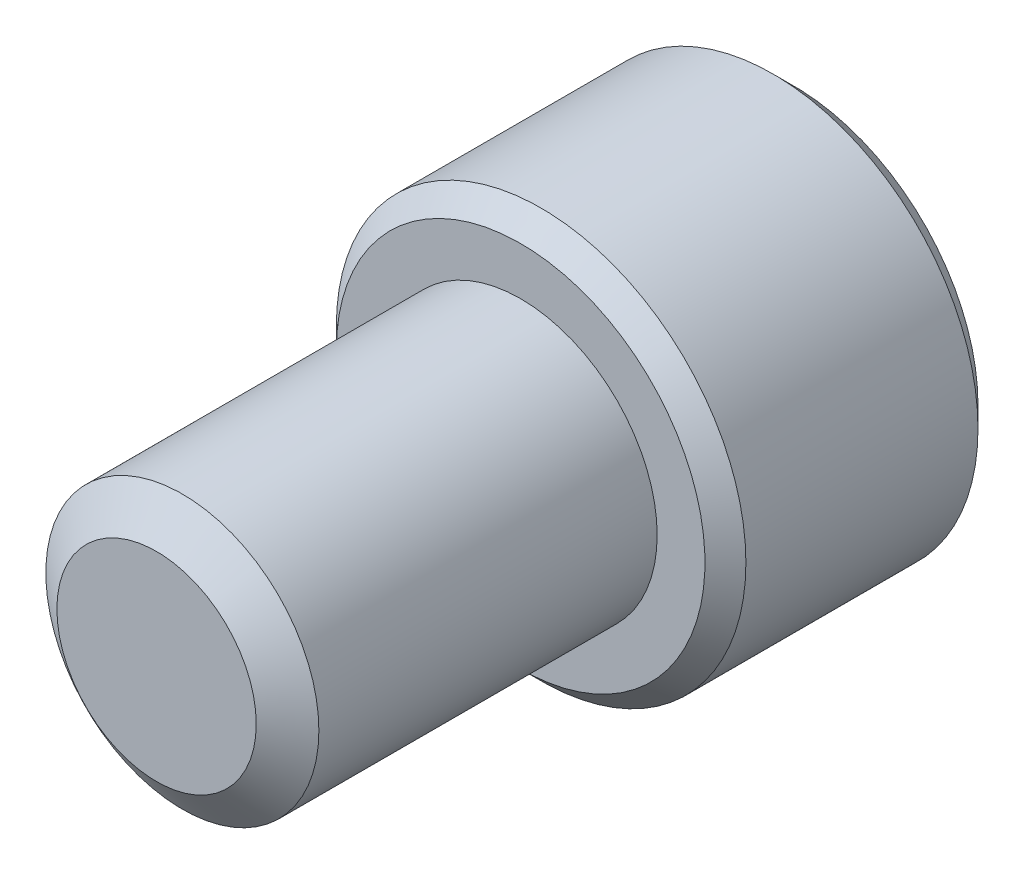
ISO-10303-21;
HEADER;
FILE_DESCRIPTION(('STEP AP214'),'2;1');
FILE_NAME('part.step','',(''),(''),'','','');
FILE_SCHEMA(('AUTOMOTIVE_DESIGN { 1 0 10303 214 1 1 1 1 }'));
ENDSEC;
DATA;
#1=APPLICATION_CONTEXT('core data for automotive mechanical design processes');
#2=APPLICATION_PROTOCOL_DEFINITION('international standard','automotive_design',2000,#1);
#3=PRODUCT_CONTEXT('',#1,'mechanical');
#4=PRODUCT('Part','Part','',(#3));
#5=PRODUCT_RELATED_PRODUCT_CATEGORY('part','',(#4));
#6=PRODUCT_DEFINITION_FORMATION('','',#4);
#7=PRODUCT_DEFINITION_CONTEXT('part definition',#1,'design');
#8=PRODUCT_DEFINITION('design','',#6,#7);
#9=PRODUCT_DEFINITION_SHAPE('','',#8);
#10=(LENGTH_UNIT() NAMED_UNIT(*) SI_UNIT(.MILLI.,.METRE.));
#11=(NAMED_UNIT(*) PLANE_ANGLE_UNIT() SI_UNIT($,.RADIAN.));
#12=(NAMED_UNIT(*) SI_UNIT($,.STERADIAN.) SOLID_ANGLE_UNIT());
#13=UNCERTAINTY_MEASURE_WITH_UNIT(LENGTH_MEASURE(1.E-05),#10,'distance_accuracy_value','');
#14=(GEOMETRIC_REPRESENTATION_CONTEXT(3) GLOBAL_UNCERTAINTY_ASSIGNED_CONTEXT((#13)) GLOBAL_UNIT_ASSIGNED_CONTEXT((#10,
#11,#12)) REPRESENTATION_CONTEXT('',''));
#15=CARTESIAN_POINT('',(0.,0.,0.));
#16=DIRECTION('',(0.,0.,1.));
#17=DIRECTION('',(1.,0.,0.));
#18=AXIS2_PLACEMENT_3D('',#15,#16,#17);
#19=CARTESIAN_POINT('',(0.,0.,-12.7));
#20=DIRECTION('',(0.,0.,1.));
#21=DIRECTION('',(1.,0.,0.));
#22=AXIS2_PLACEMENT_3D('',#19,#20,#21);
#23=CYLINDRICAL_SURFACE('',#22,4.7625);
#24=CARTESIAN_POINT('',(0.,0.,-12.7));
#25=DIRECTION('',(0.,0.,-1.));
#26=DIRECTION('',(-1.,0.,0.));
#27=AXIS2_PLACEMENT_3D('',#24,#25,#26);
#28=CIRCLE('',#27,4.7625);
#29=CARTESIAN_POINT('',(-4.7625,0.,-12.7));
#30=VERTEX_POINT('',#29);
#31=EDGE_CURVE('E213',#30,#30,#28,.F.);
#32=ORIENTED_EDGE('',*,*,#31,.T.);
#33=EDGE_LOOP('',(#32));
#34=FACE_BOUND('',#33,.T.);
#35=CARTESIAN_POINT('',(0.,0.,-0.899844757205829));
#36=DIRECTION('',(0.,0.,1.));
#37=DIRECTION('',(1.,0.,0.));
#38=AXIS2_PLACEMENT_3D('',#35,#36,#37);
#39=CIRCLE('',#38,4.7625);
#40=CARTESIAN_POINT('',(4.7625,0.,-0.899844757205829));
#41=VERTEX_POINT('',#40);
#42=EDGE_CURVE('E107',#41,#41,#39,.T.);
#43=ORIENTED_EDGE('',*,*,#42,.F.);
#44=EDGE_LOOP('',(#43));
#45=FACE_BOUND('',#44,.T.);
#46=ADVANCED_FACE('F33',(#34,#45),#23,.T.);
#47=CARTESIAN_POINT('',(0.,0.,0.));
#48=DIRECTION('',(0.,0.,-1.));
#49=DIRECTION('',(-1.,0.,0.));
#50=AXIS2_PLACEMENT_3D('',#47,#48,#49);
#51=CONICAL_SURFACE('',#50,3.47738850361915,0.959931088596884);
#52=ORIENTED_EDGE('',*,*,#42,.T.);
#53=EDGE_LOOP('',(#52));
#54=FACE_BOUND('',#53,.T.);
#55=CARTESIAN_POINT('',(0.,0.,0.));
#56=DIRECTION('',(0.,0.,1.));
#57=DIRECTION('',(1.,0.,0.));
#58=AXIS2_PLACEMENT_3D('',#55,#56,#57);
#59=CIRCLE('',#58,3.47738850361915);
#60=CARTESIAN_POINT('',(3.47738850361915,0.,0.));
#61=VERTEX_POINT('',#60);
#62=EDGE_CURVE('E211',#61,#61,#59,.T.);
#63=ORIENTED_EDGE('',*,*,#62,.F.);
#64=EDGE_LOOP('',(#63));
#65=FACE_BOUND('',#64,.T.);
#66=ADVANCED_FACE('F194',(#54,#65),#51,.T.);
#67=CARTESIAN_POINT('',(0.,0.,0.));
#68=DIRECTION('',(0.,0.,1.));
#69=DIRECTION('',(1.,0.,0.));
#70=AXIS2_PLACEMENT_3D('',#67,#68,#69);
#71=PLANE('',#70);
#72=ORIENTED_EDGE('',*,*,#62,.T.);
#73=EDGE_LOOP('',(#72));
#74=FACE_BOUND('',#73,.T.);
#75=ADVANCED_FACE('F191',(#74),#71,.T.);
#76=CARTESIAN_POINT('',(0.,0.,-22.225));
#77=DIRECTION('',(0.,0.,1.));
#78=DIRECTION('',(1.,0.,0.));
#79=AXIS2_PLACEMENT_3D('',#76,#77,#78);
#80=CYLINDRICAL_SURFACE('',#79,7.14375);
#81=CARTESIAN_POINT('',(0.,0.,-21.510625));
#82=DIRECTION('',(0.,0.,-1.));
#83=DIRECTION('',(-1.,0.,0.));
#84=AXIS2_PLACEMENT_3D('',#81,#82,#83);
#85=CIRCLE('',#84,7.14375);
#86=CARTESIAN_POINT('',(7.14375,0.,-21.510625));
#87=VERTEX_POINT('',#86);
#88=EDGE_CURVE('E41',#87,#87,#85,.F.);
#89=CARTESIAN_POINT('',(0.,0.,-13.414375));
#90=DIRECTION('',(0.,0.,-1.));
#91=DIRECTION('',(-1.,0.,0.));
#92=AXIS2_PLACEMENT_3D('',#89,#90,#91);
#93=CIRCLE('',#92,7.14375);
#94=CARTESIAN_POINT('',(7.14375,0.,-13.414375));
#95=VERTEX_POINT('',#94);
#96=EDGE_CURVE('E170',#95,#95,#93,.T.);
#97=CARTESIAN_POINT('',(7.14375,0.,-21.510625));
#98=CARTESIAN_POINT('',(7.14375,0.,-21.4262890625));
#99=CARTESIAN_POINT('',(7.14375,0.,-21.341953125));
#100=CARTESIAN_POINT('',(7.14375,0.,-21.17328125));
#101=CARTESIAN_POINT('',(7.14375,0.,-21.0889453125));
#102=CARTESIAN_POINT('',(7.14375,0.,-20.9202734375));
#103=CARTESIAN_POINT('',(7.14375,0.,-20.8359375));
#104=CARTESIAN_POINT('',(7.14375,0.,-20.667265625));
#105=CARTESIAN_POINT('',(7.14375,0.,-20.5829296875));
#106=CARTESIAN_POINT('',(7.14375,0.,-20.4142578125));
#107=CARTESIAN_POINT('',(7.14375,0.,-20.329921875));
#108=CARTESIAN_POINT('',(7.14375,0.,-20.16125));
#109=CARTESIAN_POINT('',(7.14375,0.,-20.0769140625));
#110=CARTESIAN_POINT('',(7.14375,0.,-19.9082421875));
#111=CARTESIAN_POINT('',(7.14375,0.,-19.82390625));
#112=CARTESIAN_POINT('',(7.14375,0.,-19.655234375));
#113=CARTESIAN_POINT('',(7.14375,0.,-19.5708984375));
#114=CARTESIAN_POINT('',(7.14375,0.,-19.4022265625));
#115=CARTESIAN_POINT('',(7.14375,0.,-19.317890625));
#116=CARTESIAN_POINT('',(7.14375,0.,-19.14921875));
#117=CARTESIAN_POINT('',(7.14375,0.,-19.0648828125));
#118=CARTESIAN_POINT('',(7.14375,0.,-18.8962109375));
#119=CARTESIAN_POINT('',(7.14375,0.,-18.811875));
#120=CARTESIAN_POINT('',(7.14375,0.,-18.643203125));
#121=CARTESIAN_POINT('',(7.14375,0.,-18.5588671875));
#122=CARTESIAN_POINT('',(7.14375,0.,-18.3901953125));
#123=CARTESIAN_POINT('',(7.14375,0.,-18.305859375));
#124=CARTESIAN_POINT('',(7.14375,0.,-18.1371875));
#125=CARTESIAN_POINT('',(7.14375,0.,-18.0528515625));
#126=CARTESIAN_POINT('',(7.14375,0.,-17.8841796875));
#127=CARTESIAN_POINT('',(7.14375,0.,-17.79984375));
#128=CARTESIAN_POINT('',(7.14375,0.,-17.631171875));
#129=CARTESIAN_POINT('',(7.14375,0.,-17.5468359375));
#130=CARTESIAN_POINT('',(7.14375,0.,-17.3781640625));
#131=CARTESIAN_POINT('',(7.14375,0.,-17.293828125));
#132=CARTESIAN_POINT('',(7.14375,0.,-17.12515625));
#133=CARTESIAN_POINT('',(7.14375,0.,-17.0408203125));
#134=CARTESIAN_POINT('',(7.14375,0.,-16.8721484375));
#135=CARTESIAN_POINT('',(7.14375,0.,-16.7878125));
#136=CARTESIAN_POINT('',(7.14375,0.,-16.619140625));
#137=CARTESIAN_POINT('',(7.14375,0.,-16.5348046875));
#138=CARTESIAN_POINT('',(7.14375,0.,-16.3661328125));
#139=CARTESIAN_POINT('',(7.14375,0.,-16.281796875));
#140=CARTESIAN_POINT('',(7.14375,0.,-16.113125));
#141=CARTESIAN_POINT('',(7.14375,0.,-16.0287890625));
#142=CARTESIAN_POINT('',(7.14375,0.,-15.8601171875));
#143=CARTESIAN_POINT('',(7.14375,0.,-15.77578125));
#144=CARTESIAN_POINT('',(7.14375,0.,-15.607109375));
#145=CARTESIAN_POINT('',(7.14375,0.,-15.5227734375));
#146=CARTESIAN_POINT('',(7.14375,0.,-15.3541015625));
#147=CARTESIAN_POINT('',(7.14375,0.,-15.269765625));
#148=CARTESIAN_POINT('',(7.14375,0.,-15.10109375));
#149=CARTESIAN_POINT('',(7.14375,0.,-15.0167578125));
#150=CARTESIAN_POINT('',(7.14375,0.,-14.8480859375));
#151=CARTESIAN_POINT('',(7.14375,0.,-14.76375));
#152=CARTESIAN_POINT('',(7.14375,0.,-14.595078125));
#153=CARTESIAN_POINT('',(7.14375,0.,-14.5107421875));
#154=CARTESIAN_POINT('',(7.14375,0.,-14.3420703125));
#155=CARTESIAN_POINT('',(7.14375,0.,-14.257734375));
#156=CARTESIAN_POINT('',(7.14375,0.,-14.0890625));
#157=CARTESIAN_POINT('',(7.14375,0.,-14.0047265625));
#158=CARTESIAN_POINT('',(7.14375,0.,-13.8360546875));
#159=CARTESIAN_POINT('',(7.14375,0.,-13.75171875));
#160=CARTESIAN_POINT('',(7.14375,0.,-13.583046875));
#161=CARTESIAN_POINT('',(7.14375,0.,-13.4987109375));
#162=CARTESIAN_POINT('',(7.14375,0.,-13.414375));
#163=B_SPLINE_CURVE_WITH_KNOTS('',3,(#97,#98,#99,#100,#101,#102,#103,#104,#105,#106,#107,#108,
#109,#110,#111,#112,#113,#114,#115,#116,#117,#118,#119,#120,#121,#122,#123,#124,#125,#126,#127,
#128,#129,#130,#131,#132,#133,#134,#135,#136,#137,#138,#139,#140,#141,#142,#143,#144,#145,#146,
#147,#148,#149,#150,#151,#152,#153,#154,#155,#156,#157,#158,#159,#160,#161,#162),.UNSPECIFIED.,
.F.,.F.,(4,2,2,2,2,2,2,2,2,2,2,2,2,2,2,2,2,2,2,2,2,2,2,2,2,2,2,2,2,2,2,2,4),(0.,
0.253007812499997,0.506015624999998,0.759023437499999,1.01203125,1.2650390625,1.518046875,
1.7710546875,2.0240625,2.2770703125,2.53007812499999,2.7830859375,3.03609375,3.2891015625,
3.54210937499999,3.7951171875,4.048125,4.30113281249999,4.55414062499999,4.8071484375,
5.06015624999999,5.31316406249999,5.56617187499999,5.81917968749999,6.07218749999999,
6.32519531249999,6.57820312499999,6.83121093749999,7.08421874999999,7.33722656249999,
7.59023437499999,7.84324218749999,8.09624999999999),.UNSPECIFIED.);
#164=EDGE_CURVE('BSEAM175',#87,#95,#163,.T.);
#165=ORIENTED_EDGE('',*,*,#88,.T.);
#166=ORIENTED_EDGE('',*,*,#96,.T.);
#167=ORIENTED_EDGE('',*,*,#164,.T.);
#168=ORIENTED_EDGE('',*,*,#164,.F.);
#169=EDGE_LOOP('',(#165,#167,#166,#168));
#170=FACE_BOUND('',#169,.T.);
#171=ADVANCED_FACE('F175',(#170),#80,.T.);
#172=CARTESIAN_POINT('',(0.,0.,-22.225));
#173=DIRECTION('',(0.,0.,-1.));
#174=DIRECTION('',(-1.,0.,0.));
#175=AXIS2_PLACEMENT_3D('',#172,#173,#174);
#176=PLANE('',#175);
#177=CARTESIAN_POINT('',(0.,0.,-22.225));
#178=DIRECTION('',(0.,0.,-1.));
#179=DIRECTION('',(-1.,0.,0.));
#180=AXIS2_PLACEMENT_3D('',#177,#178,#179);
#181=CIRCLE('',#180,6.42937500000001);
#182=CARTESIAN_POINT('',(-6.42937500000001,0.,-22.225));
#183=VERTEX_POINT('',#182);
#184=EDGE_CURVE('E106',#183,#183,#181,.T.);
#185=ORIENTED_EDGE('',*,*,#184,.T.);
#186=EDGE_LOOP('',(#185));
#187=FACE_BOUND('',#186,.T.);
#188=CARTESIAN_POINT('',(0.,0.,-22.225));
#189=DIRECTION('',(0.,0.,-1.));
#190=DIRECTION('',(-1.,0.,0.));
#191=AXIS2_PLACEMENT_3D('',#188,#189,#190);
#192=CIRCLE('',#191,4.58271776169265);
#193=CARTESIAN_POINT('',(-3.96875,2.29135888084633,-22.225));
#194=VERTEX_POINT('',#193);
#195=CARTESIAN_POINT('',(0.,4.58271776169266,-22.225));
#196=VERTEX_POINT('',#195);
#197=EDGE_CURVE('E87',#194,#196,#192,.T.);
#198=ORIENTED_EDGE('',*,*,#197,.F.);
#199=CARTESIAN_POINT('',(-3.96875,-2.29135888084633,-22.225));
#200=VERTEX_POINT('',#199);
#201=EDGE_CURVE('E47',#200,#194,#192,.T.);
#202=ORIENTED_EDGE('',*,*,#201,.F.);
#203=CARTESIAN_POINT('',(0.,-4.58271776169265,-22.225));
#204=VERTEX_POINT('',#203);
#205=EDGE_CURVE('E272',#204,#200,#192,.T.);
#206=ORIENTED_EDGE('',*,*,#205,.F.);
#207=CARTESIAN_POINT('',(3.96875,-2.29135888084633,-22.225));
#208=VERTEX_POINT('',#207);
#209=EDGE_CURVE('E54',#208,#204,#192,.T.);
#210=ORIENTED_EDGE('',*,*,#209,.F.);
#211=CARTESIAN_POINT('',(3.96875,2.29135888084633,-22.225));
#212=VERTEX_POINT('',#211);
#213=EDGE_CURVE('E128',#212,#208,#192,.T.);
#214=ORIENTED_EDGE('',*,*,#213,.F.);
#215=EDGE_CURVE('E96',#196,#212,#192,.T.);
#216=ORIENTED_EDGE('',*,*,#215,.F.);
#217=EDGE_LOOP('',(#198,#202,#206,#210,#214,#216));
#218=FACE_BOUND('',#217,.T.);
#219=ADVANCED_FACE('F127',(#187,#218),#176,.T.);
#220=CARTESIAN_POINT('',(0.,0.,-12.7));
#221=DIRECTION('',(0.,0.,-1.));
#222=DIRECTION('',(-1.,0.,0.));
#223=AXIS2_PLACEMENT_3D('',#220,#221,#222);
#224=PLANE('',#223);
#225=CARTESIAN_POINT('',(0.,0.,-12.7));
#226=DIRECTION('',(0.,0.,-1.));
#227=DIRECTION('',(-1.,0.,0.));
#228=AXIS2_PLACEMENT_3D('',#225,#226,#227);
#229=CIRCLE('',#228,6.42937499999999);
#230=CARTESIAN_POINT('',(-6.42937499999999,0.,-12.7));
#231=VERTEX_POINT('',#230);
#232=EDGE_CURVE('E11',#231,#231,#229,.F.);
#233=ORIENTED_EDGE('',*,*,#232,.T.);
#234=EDGE_LOOP('',(#233));
#235=FACE_BOUND('',#234,.T.);
#236=ORIENTED_EDGE('',*,*,#31,.F.);
#237=EDGE_LOOP('',(#236));
#238=FACE_BOUND('',#237,.T.);
#239=ADVANCED_FACE('F184',(#235,#238),#224,.F.);
#240=CARTESIAN_POINT('',(0.,0.,-22.225));
#241=DIRECTION('',(0.,0.,-1.));
#242=DIRECTION('',(-1.,0.,0.));
#243=AXIS2_PLACEMENT_3D('',#240,#241,#242);
#244=CONICAL_SURFACE('',#243,4.58271776169265,0.78539816339745);
#245=ORIENTED_EDGE('',*,*,#215,.T.);
#246=CARTESIAN_POINT('',(-0.00020000000000008,4.58283323174649,-22.225115474418));
#247=CARTESIAN_POINT('',(0.0680436803859713,4.54343272450516,-22.1857190135033));
#248=CARTESIAN_POINT('',(0.136809584821844,4.50373071106804,-22.1475312157826));
#249=CARTESIAN_POINT('',(0.27549341570887,4.42366156397317,-22.0739413714603));
#250=CARTESIAN_POINT('',(0.345411946528988,4.38329408138283,-22.0385408464105));
#251=CARTESIAN_POINT('',(0.557707505859672,4.2607251830555,-21.9367709068352));
#252=CARTESIAN_POINT('',(0.701888834466527,4.17748205417221,-21.8752673400195));
#253=CARTESIAN_POINT('',(0.99258566036739,4.00964816348578,-21.7699392939681));
#254=CARTESIAN_POINT('',(1.13902772950243,3.92509979544998,-21.7258495742591));
#255=CARTESIAN_POINT('',(1.43514553766434,3.75413609919585,-21.6579143133903));
#256=CARTESIAN_POINT('',(1.58481220774579,3.66772600693562,-21.6340180866405));
#257=CARTESIAN_POINT('',(1.84275672965522,3.51880166777522,-21.6124580589113));
#258=CARTESIAN_POINT('',(1.95070224659486,3.45647929451231,-21.6092672072687));
#259=CARTESIAN_POINT('',(2.16641807874268,3.3319357007533,-21.6146459790003));
#260=CARTESIAN_POINT('',(2.27418831927626,3.2697145233706,-21.6232197250599));
#261=CARTESIAN_POINT('',(2.4887076557444,3.14586172671434,-21.6516386528729));
#262=CARTESIAN_POINT('',(2.59545547357325,3.08423084535545,-21.6714964410767));
#263=CARTESIAN_POINT('',(2.80711777437235,2.96202755901179,-21.7213994540715));
#264=CARTESIAN_POINT('',(2.91203239726007,2.90145507324564,-21.7514438977693));
#265=CARTESIAN_POINT('',(3.0982812496352,2.7939242481906,-21.8132572973969));
#266=CARTESIAN_POINT('',(3.18002783101947,2.74672783742306,-21.8434010313299));
#267=CARTESIAN_POINT('',(3.34205349185908,2.65318227852169,-21.9085463964783));
#268=CARTESIAN_POINT('',(3.4223325265843,2.6068331562128,-21.9435481754861));
#269=CARTESIAN_POINT('',(3.58117016791194,2.51512820123484,-22.0176249778602));
#270=CARTESIAN_POINT('',(3.65973329214443,2.46976976031083,-22.0566871925354));
#271=CARTESIAN_POINT('',(3.81540464036892,2.37989286550831,-22.1383719201149));
#272=CARTESIAN_POINT('',(3.89251372186607,2.33537391654896,-22.180992248695));
#273=CARTESIAN_POINT('',(3.96895,2.29124341079249,-22.225115474418));
#274=B_SPLINE_CURVE_WITH_KNOTS('',3,(#246,#247,#248,#249,#250,#251,#252,#253,#254,#255,#256,
#257,#258,#259,#260,#261,#262,#263,#264,#265,#266,#267,#268,#269,#270,#271,#272,#273),
.UNSPECIFIED.,.F.,.F.,(4,2,2,2,2,2,2,2,2,2,2,2,2,4),(0.,0.264281222504262,0.5287057281046,
1.06040984450884,1.58367029033774,2.10561342008457,2.47914251806345,2.85280254583609,
3.22688084694381,3.60093047093423,3.89805841615096,4.19519540263381,4.49142198422536,
4.78746803121399),.UNSPECIFIED.);
#275=EDGE_CURVE('E101',#196,#212,#274,.T.);
#276=ORIENTED_EDGE('',*,*,#275,.F.);
#277=EDGE_LOOP('',(#245,#276));
#278=FACE_BOUND('',#277,.T.);
#279=ADVANCED_FACE('F102',(#278),#244,.F.);
#280=ORIENTED_EDGE('',*,*,#213,.T.);
#281=CARTESIAN_POINT('',(3.96875,-4.56990484315645,-23.6949681576331));
#282=CARTESIAN_POINT('',(3.96875,-4.45863268424877,-23.6109744466099));
#283=CARTESIAN_POINT('',(3.96875,-4.34673751853659,-23.5277926459744));
#284=CARTESIAN_POINT('',(3.96875,-4.12145541759773,-23.3634163849863));
#285=CARTESIAN_POINT('',(3.96875,-4.00806811494044,-23.2822224287616));
#286=CARTESIAN_POINT('',(3.96875,-3.77872655840531,-23.1216080907353));
#287=CARTESIAN_POINT('',(3.96875,-3.66275922236845,-23.0422063256494));
#288=CARTESIAN_POINT('',(3.96875,-3.42885613076908,-22.8863665390494));
#289=CARTESIAN_POINT('',(3.96875,-3.31092051512029,-22.8099283081475));
#290=CARTESIAN_POINT('',(3.96875,-3.06596138286377,-22.6564091143357));
#291=CARTESIAN_POINT('',(3.96875,-2.9388037115444,-22.5795411250438));
#292=CARTESIAN_POINT('',(3.96875,-2.68152025411326,-22.4308625301378));
#293=CARTESIAN_POINT('',(3.96875,-2.55139400205451,-22.3590527257855));
#294=CARTESIAN_POINT('',(3.96875,-2.288185487324,-22.2220399077643));
#295=CARTESIAN_POINT('',(3.96875,-2.15511341733938,-22.1568174667664));
#296=CARTESIAN_POINT('',(3.96875,-1.88534004741321,-22.0344394622814));
#297=CARTESIAN_POINT('',(3.96875,-1.74864042427225,-21.9772802462412));
#298=CARTESIAN_POINT('',(3.96875,-1.48255876318204,-21.8772577192134));
#299=CARTESIAN_POINT('',(3.96875,-1.35347311146701,-21.833614131207));
#300=CARTESIAN_POINT('',(3.96875,-1.09219394236274,-21.7566829186578));
#301=CARTESIAN_POINT('',(3.96875,-0.960000211544505,-21.7233960075458));
#302=CARTESIAN_POINT('',(3.96875,-0.695492941340558,-21.6694702438101));
#303=CARTESIAN_POINT('',(3.96875,-0.563224314368353,-21.6486146869745));
#304=CARTESIAN_POINT('',(3.96875,-0.297273068724064,-21.6199564272277));
#305=CARTESIAN_POINT('',(3.96875,-0.163590697091781,-21.6121514805561));
#306=CARTESIAN_POINT('',(3.96875,0.0990312688457112,-21.610174091002));
#307=CARTESIAN_POINT('',(3.96875,0.227967389962748,-21.6155184349991));
#308=CARTESIAN_POINT('',(3.96875,0.48473519195116,-21.6384783437385));
#309=CARTESIAN_POINT('',(3.96875,0.612566764309973,-21.6560951005717));
#310=CARTESIAN_POINT('',(3.96875,0.868361511021708,-21.7029383689789));
#311=CARTESIAN_POINT('',(3.96875,0.996287921705627,-21.732362449144));
#312=CARTESIAN_POINT('',(3.96875,1.24935336573866,-21.8012511262479));
#313=CARTESIAN_POINT('',(3.96875,1.37449263136589,-21.8407148830583));
#314=CARTESIAN_POINT('',(3.96875,1.63331643386752,-21.9321181464302));
#315=CARTESIAN_POINT('',(3.96875,1.76670819120342,-21.9848783645525));
#316=CARTESIAN_POINT('',(3.96875,2.03002683124387,-22.0984987064253));
#317=CARTESIAN_POINT('',(3.96875,2.15995206580511,-22.1593626034686));
#318=CARTESIAN_POINT('',(3.96875,2.4169726125533,-22.2877422212948));
#319=CARTESIAN_POINT('',(3.96875,2.54405740766774,-22.3552788281663));
#320=CARTESIAN_POINT('',(3.96875,2.7953024456765,-22.4955111262514));
#321=CARTESIAN_POINT('',(3.96875,2.91946314953283,-22.5682059969522));
#322=CARTESIAN_POINT('',(3.96875,3.15913302861405,-22.7140188944929));
#323=CARTESIAN_POINT('',(3.96875,3.27476522917588,-22.7869357740221));
#324=CARTESIAN_POINT('',(3.96875,3.50404450455156,-22.9358358118069));
#325=CARTESIAN_POINT('',(3.96875,3.61769142806587,-23.0118192023156));
#326=CARTESIAN_POINT('',(3.96875,3.84233840610168,-23.1656765206122));
#327=CARTESIAN_POINT('',(3.96875,3.95335246245717,-23.243530077566));
#328=CARTESIAN_POINT('',(3.96875,4.17386344212358,-23.4012960406035));
#329=CARTESIAN_POINT('',(3.96875,4.28336077424872,-23.4812078746187));
#330=CARTESIAN_POINT('',(3.96875,4.39222298093245,-23.5619612225709));
#331=B_SPLINE_CURVE_WITH_KNOTS('',3,(#281,#282,#283,#284,#285,#286,#287,#288,#289,#290,#291,
#292,#293,#294,#295,#296,#297,#298,#299,#300,#301,#302,#303,#304,#305,#306,#307,#308,#309,#310,
#311,#312,#313,#314,#315,#316,#317,#318,#319,#320,#321,#322,#323,#324,#325,#326,#327,#328,#329,
#330),.UNSPECIFIED.,.F.,.F.,(4,2,2,2,2,2,2,2,2,2,2,2,2,2,2,2,2,2,2,2,2,2,2,2,4),(0.,
0.418252140016642,0.836609274713138,1.25820795995599,1.67977680274237,2.12544086340516,
2.5711753632218,3.01555437338786,3.45973143381404,3.86816421344645,4.27662512218098,
4.67774000873369,5.0787859254598,5.46531568646291,5.85188299858476,6.24520796039677,
6.63850001927392,7.06850560534098,7.49871211849048,7.9303106517192,8.36184068483129,
8.77189246592985,9.1819753622517,9.5887271056262,9.99536699280668),.UNSPECIFIED.);
#332=EDGE_CURVE('E95',#212,#208,#331,.F.);
#333=ORIENTED_EDGE('',*,*,#332,.F.);
#334=EDGE_LOOP('',(#280,#333));
#335=FACE_BOUND('',#334,.T.);
#336=ADVANCED_FACE('F278',(#335),#244,.F.);
#337=ORIENTED_EDGE('',*,*,#209,.T.);
#338=CARTESIAN_POINT('',(3.96895,-2.29124341079249,-22.225115474418));
#339=CARTESIAN_POINT('',(3.90070631961403,-2.33064391803382,-22.1857190135033));
#340=CARTESIAN_POINT('',(3.83194041517816,-2.37034593147094,-22.1475312157826));
#341=CARTESIAN_POINT('',(3.69325658429113,-2.45041507856581,-22.0739413714603));
#342=CARTESIAN_POINT('',(3.62333805347101,-2.49078256115615,-22.0385408464105));
#343=CARTESIAN_POINT('',(3.41104249414033,-2.61335145948348,-21.9367709068352));
#344=CARTESIAN_POINT('',(3.26686116553347,-2.69659458836677,-21.8752673400195));
#345=CARTESIAN_POINT('',(2.97616433963261,-2.8644284790532,-21.7699392939681));
#346=CARTESIAN_POINT('',(2.82972227049758,-2.948976847089,-21.7258495742591));
#347=CARTESIAN_POINT('',(2.53360446233566,-3.11994054334313,-21.6579143133903));
#348=CARTESIAN_POINT('',(2.38393779225422,-3.20635063560336,-21.6340180866405));
#349=CARTESIAN_POINT('',(2.12599327034478,-3.35527497476376,-21.6124580589113));
#350=CARTESIAN_POINT('',(2.01804775340515,-3.41759734802667,-21.6092672072687));
#351=CARTESIAN_POINT('',(1.80233192125732,-3.54214094178568,-21.6146459790003));
#352=CARTESIAN_POINT('',(1.69456168072374,-3.60436211916838,-21.6232197250599));
#353=CARTESIAN_POINT('',(1.4800423442556,-3.72821491582464,-21.6516386528729));
#354=CARTESIAN_POINT('',(1.37329452642676,-3.78984579718353,-21.6714964410767));
#355=CARTESIAN_POINT('',(1.16163222562765,-3.91204908352719,-21.7213994540715));
#356=CARTESIAN_POINT('',(1.05671760273993,-3.97262156929334,-21.7514438977693));
#357=CARTESIAN_POINT('',(0.870468750364803,-4.08015239434838,-21.8132572973969));
#358=CARTESIAN_POINT('',(0.788722168980529,-4.12734880511592,-21.8434010313299));
#359=CARTESIAN_POINT('',(0.626696508140925,-4.22089436401729,-21.9085463964783));
#360=CARTESIAN_POINT('',(0.546417473415704,-4.26724348632618,-21.9435481754861));
#361=CARTESIAN_POINT('',(0.387579832088066,-4.35894844130414,-22.0176249778602));
#362=CARTESIAN_POINT('',(0.309016707855576,-4.40430688222815,-22.0566871925354));
#363=CARTESIAN_POINT('',(0.153345359631081,-4.49418377703067,-22.1383719201149));
#364=CARTESIAN_POINT('',(0.0762362781339246,-4.53870272599002,-22.180992248695));
#365=CARTESIAN_POINT('',(-0.000200000000000287,-4.58283323174649,-22.225115474418));
#366=B_SPLINE_CURVE_WITH_KNOTS('',3,(#338,#339,#340,#341,#342,#343,#344,#345,#346,#347,#348,
#349,#350,#351,#352,#353,#354,#355,#356,#357,#358,#359,#360,#361,#362,#363,#364,#365),
.UNSPECIFIED.,.F.,.F.,(4,2,2,2,2,2,2,2,2,2,2,2,2,4),(0.,0.264281222504262,0.528705728104598,
1.06040984450884,1.58367029033774,2.10561342008456,2.47914251806345,2.85280254583609,
3.22688084694381,3.60093047093423,3.89805841615096,4.19519540263381,4.49142198422536,
4.78746803121399),.UNSPECIFIED.);
#367=EDGE_CURVE('E138',#208,#204,#366,.T.);
#368=ORIENTED_EDGE('',*,*,#367,.F.);
#369=EDGE_LOOP('',(#337,#368));
#370=FACE_BOUND('',#369,.T.);
#371=ADVANCED_FACE('F275',(#370),#244,.F.);
#372=ORIENTED_EDGE('',*,*,#205,.T.);
#373=CARTESIAN_POINT('',(0.000200000000000329,-4.58283323174649,-22.225115474418));
#374=CARTESIAN_POINT('',(-0.0680436803859701,-4.54343272450516,-22.1857190135033));
#375=CARTESIAN_POINT('',(-0.136809584821843,-4.50373071106804,-22.1475312157826));
#376=CARTESIAN_POINT('',(-0.27549341570887,-4.42366156397317,-22.0739413714603));
#377=CARTESIAN_POINT('',(-0.345411946528988,-4.38329408138283,-22.0385408464105));
#378=CARTESIAN_POINT('',(-0.557707505859673,-4.2607251830555,-21.9367709068352));
#379=CARTESIAN_POINT('',(-0.701888834466526,-4.17748205417221,-21.8752673400195));
#380=CARTESIAN_POINT('',(-0.992585660367389,-4.00964816348578,-21.7699392939681));
#381=CARTESIAN_POINT('',(-1.13902772950242,-3.92509979544998,-21.7258495742591));
#382=CARTESIAN_POINT('',(-1.43514553766434,-3.75413609919586,-21.6579143133903));
#383=CARTESIAN_POINT('',(-1.58481220774579,-3.66772600693562,-21.6340180866405));
#384=CARTESIAN_POINT('',(-1.84275672965522,-3.51880166777522,-21.6124580589113));
#385=CARTESIAN_POINT('',(-1.95070224659486,-3.45647929451231,-21.6092672072687));
#386=CARTESIAN_POINT('',(-2.16641807874268,-3.3319357007533,-21.6146459790003));
#387=CARTESIAN_POINT('',(-2.27418831927626,-3.2697145233706,-21.6232197250599));
#388=CARTESIAN_POINT('',(-2.4887076557444,-3.14586172671434,-21.6516386528729));
#389=CARTESIAN_POINT('',(-2.59545547357325,-3.08423084535545,-21.6714964410767));
#390=CARTESIAN_POINT('',(-2.80711777437235,-2.96202755901179,-21.7213994540715));
#391=CARTESIAN_POINT('',(-2.91203239726007,-2.90145507324564,-21.7514438977693));
#392=CARTESIAN_POINT('',(-3.0982812496352,-2.7939242481906,-21.8132572973969));
#393=CARTESIAN_POINT('',(-3.18002783101947,-2.74672783742306,-21.8434010313299));
#394=CARTESIAN_POINT('',(-3.34205349185908,-2.65318227852169,-21.9085463964783));
#395=CARTESIAN_POINT('',(-3.4223325265843,-2.6068331562128,-21.9435481754861));
#396=CARTESIAN_POINT('',(-3.58117016791194,-2.51512820123484,-22.0176249778602));
#397=CARTESIAN_POINT('',(-3.65973329214443,-2.46976976031084,-22.0566871925354));
#398=CARTESIAN_POINT('',(-3.81540464036892,-2.37989286550831,-22.1383719201149));
#399=CARTESIAN_POINT('',(-3.89251372186607,-2.33537391654897,-22.180992248695));
#400=CARTESIAN_POINT('',(-3.96895,-2.29124341079249,-22.225115474418));
#401=B_SPLINE_CURVE_WITH_KNOTS('',3,(#373,#374,#375,#376,#377,#378,#379,#380,#381,#382,#383,
#384,#385,#386,#387,#388,#389,#390,#391,#392,#393,#394,#395,#396,#397,#398,#399,#400),
.UNSPECIFIED.,.F.,.F.,(4,2,2,2,2,2,2,2,2,2,2,2,2,4),(0.,0.264281222504264,0.528705728104599,
1.06040984450885,1.58367029033774,2.10561342008457,2.47914251806345,2.85280254583609,
3.22688084694382,3.60093047093423,3.89805841615096,4.19519540263381,4.49142198422536,
4.78746803121399),.UNSPECIFIED.);
#402=EDGE_CURVE('E249',#204,#200,#401,.T.);
#403=ORIENTED_EDGE('',*,*,#402,.F.);
#404=EDGE_LOOP('',(#372,#403));
#405=FACE_BOUND('',#404,.T.);
#406=ADVANCED_FACE('F274',(#405),#244,.F.);
#407=ORIENTED_EDGE('',*,*,#201,.T.);
#408=CARTESIAN_POINT('',(-3.96875,-4.56990484315645,-23.6949681576331));
#409=CARTESIAN_POINT('',(-3.96875,-4.45863268424877,-23.6109744466099));
#410=CARTESIAN_POINT('',(-3.96875,-4.34673751853659,-23.5277926459744));
#411=CARTESIAN_POINT('',(-3.96875,-4.12145541759773,-23.3634163849863));
#412=CARTESIAN_POINT('',(-3.96875,-4.00806811494044,-23.2822224287616));
#413=CARTESIAN_POINT('',(-3.96875,-3.77872655840531,-23.1216080907353));
#414=CARTESIAN_POINT('',(-3.96875,-3.66275922236845,-23.0422063256494));
#415=CARTESIAN_POINT('',(-3.96875,-3.42885613076908,-22.8863665390494));
#416=CARTESIAN_POINT('',(-3.96875,-3.31092051512029,-22.8099283081475));
#417=CARTESIAN_POINT('',(-3.96875,-3.06596138286377,-22.6564091143357));
#418=CARTESIAN_POINT('',(-3.96875,-2.9388037115444,-22.5795411250438));
#419=CARTESIAN_POINT('',(-3.96875,-2.68152025411326,-22.4308625301378));
#420=CARTESIAN_POINT('',(-3.96875,-2.55139400205451,-22.3590527257855));
#421=CARTESIAN_POINT('',(-3.96875,-2.288185487324,-22.2220399077643));
#422=CARTESIAN_POINT('',(-3.96875,-2.15511341733938,-22.1568174667664));
#423=CARTESIAN_POINT('',(-3.96875,-1.88534004741321,-22.0344394622814));
#424=CARTESIAN_POINT('',(-3.96875,-1.74864042427225,-21.9772802462412));
#425=CARTESIAN_POINT('',(-3.96875,-1.48255876318204,-21.8772577192134));
#426=CARTESIAN_POINT('',(-3.96875,-1.35347311146701,-21.833614131207));
#427=CARTESIAN_POINT('',(-3.96875,-1.09219394236274,-21.7566829186578));
#428=CARTESIAN_POINT('',(-3.96875,-0.960000211544505,-21.7233960075458));
#429=CARTESIAN_POINT('',(-3.96875,-0.695492941340558,-21.6694702438101));
#430=CARTESIAN_POINT('',(-3.96875,-0.563224314368353,-21.6486146869745));
#431=CARTESIAN_POINT('',(-3.96875,-0.297273068724064,-21.6199564272277));
#432=CARTESIAN_POINT('',(-3.96875,-0.163590697091781,-21.6121514805561));
#433=CARTESIAN_POINT('',(-3.96875,0.0990312688457112,-21.610174091002));
#434=CARTESIAN_POINT('',(-3.96875,0.227967389962748,-21.6155184349991));
#435=CARTESIAN_POINT('',(-3.96875,0.48473519195116,-21.6384783437385));
#436=CARTESIAN_POINT('',(-3.96875,0.612566764309973,-21.6560951005717));
#437=CARTESIAN_POINT('',(-3.96875,0.868361511021708,-21.7029383689789));
#438=CARTESIAN_POINT('',(-3.96875,0.996287921705627,-21.732362449144));
#439=CARTESIAN_POINT('',(-3.96875,1.24935336573866,-21.8012511262479));
#440=CARTESIAN_POINT('',(-3.96875,1.37449263136589,-21.8407148830583));
#441=CARTESIAN_POINT('',(-3.96875,1.63331643386752,-21.9321181464302));
#442=CARTESIAN_POINT('',(-3.96875,1.76670819120342,-21.9848783645525));
#443=CARTESIAN_POINT('',(-3.96875,2.03002683124387,-22.0984987064253));
#444=CARTESIAN_POINT('',(-3.96875,2.15995206580511,-22.1593626034686));
#445=CARTESIAN_POINT('',(-3.96875,2.4169726125533,-22.2877422212948));
#446=CARTESIAN_POINT('',(-3.96875,2.54405740766774,-22.3552788281663));
#447=CARTESIAN_POINT('',(-3.96875,2.7953024456765,-22.4955111262514));
#448=CARTESIAN_POINT('',(-3.96875,2.91946314953283,-22.5682059969522));
#449=CARTESIAN_POINT('',(-3.96875,3.15913302861405,-22.7140188944929));
#450=CARTESIAN_POINT('',(-3.96875,3.27476522917588,-22.7869357740221));
#451=CARTESIAN_POINT('',(-3.96875,3.50404450455156,-22.9358358118069));
#452=CARTESIAN_POINT('',(-3.96875,3.61769142806587,-23.0118192023156));
#453=CARTESIAN_POINT('',(-3.96875,3.84233840610168,-23.1656765206122));
#454=CARTESIAN_POINT('',(-3.96875,3.95335246245717,-23.243530077566));
#455=CARTESIAN_POINT('',(-3.96875,4.17386344212358,-23.4012960406035));
#456=CARTESIAN_POINT('',(-3.96875,4.28336077424872,-23.4812078746187));
#457=CARTESIAN_POINT('',(-3.96875,4.39222298093245,-23.5619612225709));
#458=B_SPLINE_CURVE_WITH_KNOTS('',3,(#408,#409,#410,#411,#412,#413,#414,#415,#416,#417,#418,
#419,#420,#421,#422,#423,#424,#425,#426,#427,#428,#429,#430,#431,#432,#433,#434,#435,#436,#437,
#438,#439,#440,#441,#442,#443,#444,#445,#446,#447,#448,#449,#450,#451,#452,#453,#454,#455,#456,
#457),.UNSPECIFIED.,.F.,.F.,(4,2,2,2,2,2,2,2,2,2,2,2,2,2,2,2,2,2,2,2,2,2,2,2,4),(0.,
0.418252140016642,0.836609274713138,1.25820795995599,1.67977680274237,2.12544086340516,
2.5711753632218,3.01555437338786,3.45973143381404,3.86816421344645,4.27662512218098,
4.67774000873369,5.0787859254598,5.46531568646291,5.85188299858476,6.24520796039677,
6.63850001927392,7.06850560534098,7.49871211849048,7.9303106517192,8.36184068483129,
8.77189246592985,9.1819753622517,9.5887271056262,9.99536699280668),.UNSPECIFIED.);
#459=EDGE_CURVE('E117',#200,#194,#458,.T.);
#460=ORIENTED_EDGE('',*,*,#459,.F.);
#461=EDGE_LOOP('',(#407,#460));
#462=FACE_BOUND('',#461,.T.);
#463=ADVANCED_FACE('F287',(#462),#244,.F.);
#464=ORIENTED_EDGE('',*,*,#197,.T.);
#465=CARTESIAN_POINT('',(-3.96895,2.29124341079249,-22.225115474418));
#466=CARTESIAN_POINT('',(-3.90070631961403,2.33064391803382,-22.1857190135033));
#467=CARTESIAN_POINT('',(-3.83194041517816,2.37034593147094,-22.1475312157826));
#468=CARTESIAN_POINT('',(-3.69325658429113,2.45041507856581,-22.0739413714603));
#469=CARTESIAN_POINT('',(-3.62333805347101,2.49078256115615,-22.0385408464105));
#470=CARTESIAN_POINT('',(-3.41104249414033,2.61335145948349,-21.9367709068352));
#471=CARTESIAN_POINT('',(-3.26686116553347,2.69659458836677,-21.8752673400195));
#472=CARTESIAN_POINT('',(-2.97616433963261,2.8644284790532,-21.7699392939681));
#473=CARTESIAN_POINT('',(-2.82972227049757,2.948976847089,-21.7258495742591));
#474=CARTESIAN_POINT('',(-2.53360446233566,3.11994054334313,-21.6579143133903));
#475=CARTESIAN_POINT('',(-2.38393779225421,3.20635063560336,-21.6340180866405));
#476=CARTESIAN_POINT('',(-2.12599327034478,3.35527497476376,-21.6124580589113));
#477=CARTESIAN_POINT('',(-2.01804775340514,3.41759734802667,-21.6092672072687));
#478=CARTESIAN_POINT('',(-1.80233192125732,3.54214094178569,-21.6146459790003));
#479=CARTESIAN_POINT('',(-1.69456168072374,3.60436211916838,-21.6232197250599));
#480=CARTESIAN_POINT('',(-1.4800423442556,3.72821491582464,-21.6516386528729));
#481=CARTESIAN_POINT('',(-1.37329452642675,3.78984579718353,-21.6714964410767));
#482=CARTESIAN_POINT('',(-1.16163222562765,3.91204908352719,-21.7213994540715));
#483=CARTESIAN_POINT('',(-1.05671760273993,3.97262156929334,-21.7514438977693));
#484=CARTESIAN_POINT('',(-0.870468750364801,4.08015239434838,-21.8132572973969));
#485=CARTESIAN_POINT('',(-0.788722168980527,4.12734880511592,-21.8434010313299));
#486=CARTESIAN_POINT('',(-0.626696508140922,4.22089436401729,-21.9085463964783));
#487=CARTESIAN_POINT('',(-0.546417473415701,4.26724348632618,-21.9435481754861));
#488=CARTESIAN_POINT('',(-0.387579832088064,4.35894844130414,-22.0176249778602));
#489=CARTESIAN_POINT('',(-0.309016707855575,4.40430688222815,-22.0566871925354));
#490=CARTESIAN_POINT('',(-0.153345359631081,4.49418377703067,-22.1383719201149));
#491=CARTESIAN_POINT('',(-0.0762362781339249,4.53870272599002,-22.180992248695));
#492=CARTESIAN_POINT('',(0.000200000000000161,4.58283323174649,-22.225115474418));
#493=B_SPLINE_CURVE_WITH_KNOTS('',3,(#465,#466,#467,#468,#469,#470,#471,#472,#473,#474,#475,
#476,#477,#478,#479,#480,#481,#482,#483,#484,#485,#486,#487,#488,#489,#490,#491,#492),
.UNSPECIFIED.,.F.,.F.,(4,2,2,2,2,2,2,2,2,2,2,2,2,4),(0.,0.264281222504265,0.5287057281046,
1.06040984450885,1.58367029033774,2.10561342008457,2.47914251806345,2.85280254583609,
3.22688084694382,3.60093047093423,3.89805841615096,4.19519540263381,4.49142198422536,
4.78746803121399),.UNSPECIFIED.);
#494=EDGE_CURVE('E91',#194,#196,#493,.T.);
#495=ORIENTED_EDGE('',*,*,#494,.F.);
#496=EDGE_LOOP('',(#464,#495));
#497=FACE_BOUND('',#496,.T.);
#498=ADVANCED_FACE('F89',(#497),#244,.F.);
#499=CARTESIAN_POINT('',(3.96875,6.87407664253898,-16.271875));
#500=DIRECTION('',(0.,0.,-1.));
#501=DIRECTION('',(-1.,0.,0.));
#502=AXIS2_PLACEMENT_3D('',#499,#500,#501);
#503=PLANE('',#502);
#504=DIRECTION('',(0.866025403784439,0.5,0.));
#505=VECTOR('',#504,1.);
#506=CARTESIAN_POINT('',(-3.96875,2.29135888084633,-16.271875));
#507=LINE('',#506,#505);
#508=CARTESIAN_POINT('',(-3.96875,2.29135888084633,-16.271875));
#509=VERTEX_POINT('',#508);
#510=CARTESIAN_POINT('',(0.,4.58271776169265,-16.271875));
#511=VERTEX_POINT('',#510);
#512=EDGE_CURVE('E116',#509,#511,#507,.T.);
#513=ORIENTED_EDGE('',*,*,#512,.T.);
#514=DIRECTION('',(0.866025403784439,-0.5,0.));
#515=VECTOR('',#514,1.);
#516=CARTESIAN_POINT('',(0.,4.58271776169265,-16.271875));
#517=LINE('',#516,#515);
#518=CARTESIAN_POINT('',(3.96875,2.29135888084633,-16.271875));
#519=VERTEX_POINT('',#518);
#520=EDGE_CURVE('E121',#511,#519,#517,.T.);
#521=ORIENTED_EDGE('',*,*,#520,.T.);
#522=DIRECTION('',(0.,-1.,0.));
#523=VECTOR('',#522,1.);
#524=CARTESIAN_POINT('',(3.96875,2.29135888084633,-16.271875));
#525=LINE('',#524,#523);
#526=CARTESIAN_POINT('',(3.96875,-2.29135888084633,-16.271875));
#527=VERTEX_POINT('',#526);
#528=EDGE_CURVE('E235',#519,#527,#525,.T.);
#529=ORIENTED_EDGE('',*,*,#528,.T.);
#530=DIRECTION('',(-0.866025403784439,-0.5,0.));
#531=VECTOR('',#530,1.);
#532=CARTESIAN_POINT('',(3.96875,-2.29135888084633,-16.271875));
#533=LINE('',#532,#531);
#534=CARTESIAN_POINT('',(0.,-4.58271776169265,-16.271875));
#535=VERTEX_POINT('',#534);
#536=EDGE_CURVE('E232',#527,#535,#533,.T.);
#537=ORIENTED_EDGE('',*,*,#536,.T.);
#538=DIRECTION('',(-0.866025403784439,0.5,0.));
#539=VECTOR('',#538,1.);
#540=CARTESIAN_POINT('',(0.,-4.58271776169265,-16.271875));
#541=LINE('',#540,#539);
#542=CARTESIAN_POINT('',(-3.96875,-2.29135888084633,-16.271875));
#543=VERTEX_POINT('',#542);
#544=EDGE_CURVE('E229',#535,#543,#541,.T.);
#545=ORIENTED_EDGE('',*,*,#544,.T.);
#546=DIRECTION('',(0.,1.,0.));
#547=VECTOR('',#546,1.);
#548=CARTESIAN_POINT('',(-3.96875,-2.29135888084633,-16.271875));
#549=LINE('',#548,#547);
#550=EDGE_CURVE('E124',#543,#509,#549,.T.);
#551=ORIENTED_EDGE('',*,*,#550,.T.);
#552=EDGE_LOOP('',(#513,#521,#529,#537,#545,#551));
#553=FACE_BOUND('',#552,.T.);
#554=ADVANCED_FACE('F158',(#553),#503,.T.);
#555=CARTESIAN_POINT('',(0.,4.58271776169265,-16.271875));
#556=DIRECTION('',(0.5,0.866025403784439,0.));
#557=DIRECTION('',(-0.866025403784439,0.5,0.));
#558=AXIS2_PLACEMENT_3D('',#555,#556,#557);
#559=PLANE('',#558);
#560=DIRECTION('',(0.,0.,-1.));
#561=VECTOR('',#560,1.);
#562=CARTESIAN_POINT('',(0.,4.58271776169265,-16.271875));
#563=LINE('',#562,#561);
#564=EDGE_CURVE('E113',#511,#196,#563,.T.);
#565=ORIENTED_EDGE('',*,*,#564,.T.);
#566=ORIENTED_EDGE('',*,*,#275,.T.);
#567=DIRECTION('',(0.,0.,-1.));
#568=VECTOR('',#567,1.);
#569=CARTESIAN_POINT('',(3.96875,2.29135888084633,-16.271875));
#570=LINE('',#569,#568);
#571=EDGE_CURVE('E123',#519,#212,#570,.T.);
#572=ORIENTED_EDGE('',*,*,#571,.F.);
#573=ORIENTED_EDGE('',*,*,#520,.F.);
#574=EDGE_LOOP('',(#565,#566,#572,#573));
#575=FACE_BOUND('',#574,.T.);
#576=ADVANCED_FACE('F119',(#575),#559,.F.);
#577=CARTESIAN_POINT('',(3.96875,2.29135888084633,-16.271875));
#578=DIRECTION('',(1.,0.,0.));
#579=DIRECTION('',(0.,0.,-1.));
#580=AXIS2_PLACEMENT_3D('',#577,#578,#579);
#581=PLANE('',#580);
#582=ORIENTED_EDGE('',*,*,#571,.T.);
#583=ORIENTED_EDGE('',*,*,#332,.T.);
#584=DIRECTION('',(0.,0.,-1.));
#585=VECTOR('',#584,1.);
#586=CARTESIAN_POINT('',(3.96875,-2.29135888084633,-16.271875));
#587=LINE('',#586,#585);
#588=EDGE_CURVE('E218',#527,#208,#587,.T.);
#589=ORIENTED_EDGE('',*,*,#588,.F.);
#590=ORIENTED_EDGE('',*,*,#528,.F.);
#591=EDGE_LOOP('',(#582,#583,#589,#590));
#592=FACE_BOUND('',#591,.T.);
#593=ADVANCED_FACE('F147',(#592),#581,.F.);
#594=CARTESIAN_POINT('',(3.96875,-2.29135888084633,-16.271875));
#595=DIRECTION('',(0.5,-0.866025403784439,0.));
#596=DIRECTION('',(0.866025403784439,0.5,0.));
#597=AXIS2_PLACEMENT_3D('',#594,#595,#596);
#598=PLANE('',#597);
#599=ORIENTED_EDGE('',*,*,#588,.T.);
#600=ORIENTED_EDGE('',*,*,#367,.T.);
#601=DIRECTION('',(0.,0.,-1.));
#602=VECTOR('',#601,1.);
#603=CARTESIAN_POINT('',(0.,-4.58271776169265,-16.271875));
#604=LINE('',#603,#602);
#605=EDGE_CURVE('E221',#535,#204,#604,.T.);
#606=ORIENTED_EDGE('',*,*,#605,.F.);
#607=ORIENTED_EDGE('',*,*,#536,.F.);
#608=EDGE_LOOP('',(#599,#600,#606,#607));
#609=FACE_BOUND('',#608,.T.);
#610=ADVANCED_FACE('F151',(#609),#598,.F.);
#611=CARTESIAN_POINT('',(0.,-4.58271776169265,-16.271875));
#612=DIRECTION('',(-0.5,-0.866025403784439,0.));
#613=DIRECTION('',(0.866025403784439,-0.5,0.));
#614=AXIS2_PLACEMENT_3D('',#611,#612,#613);
#615=PLANE('',#614);
#616=ORIENTED_EDGE('',*,*,#605,.T.);
#617=ORIENTED_EDGE('',*,*,#402,.T.);
#618=DIRECTION('',(0.,0.,-1.));
#619=VECTOR('',#618,1.);
#620=CARTESIAN_POINT('',(-3.96875,-2.29135888084633,-16.271875));
#621=LINE('',#620,#619);
#622=EDGE_CURVE('E224',#543,#200,#621,.T.);
#623=ORIENTED_EDGE('',*,*,#622,.F.);
#624=ORIENTED_EDGE('',*,*,#544,.F.);
#625=EDGE_LOOP('',(#616,#617,#623,#624));
#626=FACE_BOUND('',#625,.T.);
#627=ADVANCED_FACE('F257',(#626),#615,.F.);
#628=CARTESIAN_POINT('',(-3.96875,-2.29135888084633,-16.271875));
#629=DIRECTION('',(-1.,0.,0.));
#630=DIRECTION('',(0.,0.,1.));
#631=AXIS2_PLACEMENT_3D('',#628,#629,#630);
#632=PLANE('',#631);
#633=ORIENTED_EDGE('',*,*,#622,.T.);
#634=ORIENTED_EDGE('',*,*,#459,.T.);
#635=DIRECTION('',(0.,0.,-1.));
#636=VECTOR('',#635,1.);
#637=CARTESIAN_POINT('',(-3.96875,2.29135888084633,-16.271875));
#638=LINE('',#637,#636);
#639=EDGE_CURVE('E115',#509,#194,#638,.T.);
#640=ORIENTED_EDGE('',*,*,#639,.F.);
#641=ORIENTED_EDGE('',*,*,#550,.F.);
#642=EDGE_LOOP('',(#633,#634,#640,#641));
#643=FACE_BOUND('',#642,.T.);
#644=ADVANCED_FACE('F254',(#643),#632,.F.);
#645=CARTESIAN_POINT('',(-3.96875,2.29135888084633,-16.271875));
#646=DIRECTION('',(-0.5,0.866025403784439,0.));
#647=DIRECTION('',(-0.866025403784439,-0.5,0.));
#648=AXIS2_PLACEMENT_3D('',#645,#646,#647);
#649=PLANE('',#648);
#650=ORIENTED_EDGE('',*,*,#639,.T.);
#651=ORIENTED_EDGE('',*,*,#494,.T.);
#652=ORIENTED_EDGE('',*,*,#564,.F.);
#653=ORIENTED_EDGE('',*,*,#512,.F.);
#654=EDGE_LOOP('',(#650,#651,#652,#653));
#655=FACE_BOUND('',#654,.T.);
#656=ADVANCED_FACE('F111',(#655),#649,.F.);
#657=CARTESIAN_POINT('',(0.,0.,-22.225));
#658=DIRECTION('',(0.,0.,1.));
#659=DIRECTION('',(1.,0.,0.));
#660=AXIS2_PLACEMENT_3D('',#657,#658,#659);
#661=CONICAL_SURFACE('',#660,6.42937500000001,0.785398163397446);
#662=ORIENTED_EDGE('',*,*,#88,.F.);
#663=EDGE_LOOP('',(#662));
#664=FACE_BOUND('',#663,.T.);
#665=ORIENTED_EDGE('',*,*,#184,.F.);
#666=EDGE_LOOP('',(#665));
#667=FACE_BOUND('',#666,.T.);
#668=ADVANCED_FACE('F178',(#664,#667),#661,.T.);
#669=CARTESIAN_POINT('',(0.,0.,-13.414375));
#670=DIRECTION('',(0.,0.,-1.));
#671=DIRECTION('',(-1.,0.,0.));
#672=AXIS2_PLACEMENT_3D('',#669,#670,#671);
#673=CONICAL_SURFACE('',#672,7.14375,0.78539816339745);
#674=ORIENTED_EDGE('',*,*,#232,.F.);
#675=EDGE_LOOP('',(#674));
#676=FACE_BOUND('',#675,.T.);
#677=ORIENTED_EDGE('',*,*,#96,.F.);
#678=EDGE_LOOP('',(#677));
#679=FACE_BOUND('',#678,.T.);
#680=ADVANCED_FACE('F35',(#676,#679),#673,.T.);
#681=CLOSED_SHELL('',(#46,#66,#75,#171,#219,#239,#279,#336,#371,#406,#463,#498,#554,#576,#593,
#610,#627,#644,#656,#668,#680));
#682=MANIFOLD_SOLID_BREP('B2',#681);
#683=ADVANCED_BREP_SHAPE_REPRESENTATION('',(#18,#682),#14);
#684=SHAPE_DEFINITION_REPRESENTATION(#9,#683);
ENDSEC;
END-ISO-10303-21;
